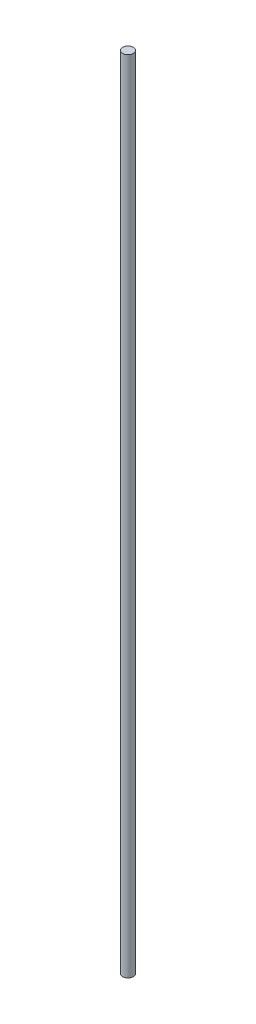
ISO-10303-21;
HEADER;
FILE_DESCRIPTION(('STEP AP214'),'2;1');
FILE_NAME('part.step','',(''),(''),'','','');
FILE_SCHEMA(('AUTOMOTIVE_DESIGN { 1 0 10303 214 1 1 1 1 }'));
ENDSEC;
DATA;
#1=APPLICATION_CONTEXT('core data for automotive mechanical design processes');
#2=APPLICATION_PROTOCOL_DEFINITION('international standard','automotive_design',2000,#1);
#3=PRODUCT_CONTEXT('',#1,'mechanical');
#4=PRODUCT('Part','Part','',(#3));
#5=PRODUCT_RELATED_PRODUCT_CATEGORY('part','',(#4));
#6=PRODUCT_DEFINITION_FORMATION('','',#4);
#7=PRODUCT_DEFINITION_CONTEXT('part definition',#1,'design');
#8=PRODUCT_DEFINITION('design','',#6,#7);
#9=PRODUCT_DEFINITION_SHAPE('','',#8);
#10=(LENGTH_UNIT() NAMED_UNIT(*) SI_UNIT(.MILLI.,.METRE.));
#11=(NAMED_UNIT(*) PLANE_ANGLE_UNIT() SI_UNIT($,.RADIAN.));
#12=(NAMED_UNIT(*) SI_UNIT($,.STERADIAN.) SOLID_ANGLE_UNIT());
#13=UNCERTAINTY_MEASURE_WITH_UNIT(LENGTH_MEASURE(1.E-05),#10,'distance_accuracy_value','');
#14=(GEOMETRIC_REPRESENTATION_CONTEXT(3) GLOBAL_UNCERTAINTY_ASSIGNED_CONTEXT((#13)) GLOBAL_UNIT_ASSIGNED_CONTEXT((#10,
#11,#12)) REPRESENTATION_CONTEXT('',''));
#15=CARTESIAN_POINT('',(0.,0.,0.));
#16=DIRECTION('',(0.,0.,1.));
#17=DIRECTION('',(1.,0.,0.));
#18=AXIS2_PLACEMENT_3D('',#15,#16,#17);
#19=CARTESIAN_POINT('',(0.,1500.,0.));
#20=DIRECTION('',(0.,-1.,0.));
#21=DIRECTION('',(0.,0.,-1.));
#22=AXIS2_PLACEMENT_3D('',#19,#20,#21);
#23=CYLINDRICAL_SURFACE('',#22,10.);
#24=CARTESIAN_POINT('',(0.,1500.,0.));
#25=DIRECTION('',(0.,1.,0.));
#26=DIRECTION('',(0.,0.,1.));
#27=AXIS2_PLACEMENT_3D('',#24,#25,#26);
#28=CIRCLE('',#27,10.);
#29=CARTESIAN_POINT('',(0.,1500.,10.));
#30=VERTEX_POINT('',#29);
#31=EDGE_CURVE('E10',#30,#30,#28,.T.);
#32=ORIENTED_EDGE('',*,*,#31,.F.);
#33=EDGE_LOOP('',(#32));
#34=FACE_BOUND('',#33,.T.);
#35=CARTESIAN_POINT('',(0.,0.,0.));
#36=DIRECTION('',(0.,1.,0.));
#37=DIRECTION('',(0.,0.,1.));
#38=AXIS2_PLACEMENT_3D('',#35,#36,#37);
#39=CIRCLE('',#38,10.);
#40=CARTESIAN_POINT('',(0.,0.,10.));
#41=VERTEX_POINT('',#40);
#42=EDGE_CURVE('E34',#41,#41,#39,.T.);
#43=ORIENTED_EDGE('',*,*,#42,.T.);
#44=EDGE_LOOP('',(#43));
#45=FACE_BOUND('',#44,.T.);
#46=ADVANCED_FACE('F31',(#34,#45),#23,.T.);
#47=CARTESIAN_POINT('',(0.,1500.,0.));
#48=DIRECTION('',(0.,1.,0.));
#49=DIRECTION('',(0.,0.,1.));
#50=AXIS2_PLACEMENT_3D('',#47,#48,#49);
#51=PLANE('',#50);
#52=ORIENTED_EDGE('',*,*,#31,.T.);
#53=EDGE_LOOP('',(#52));
#54=FACE_BOUND('',#53,.T.);
#55=ADVANCED_FACE('F46',(#54),#51,.T.);
#56=CARTESIAN_POINT('',(0.,0.,0.));
#57=DIRECTION('',(0.,1.,0.));
#58=DIRECTION('',(0.,0.,1.));
#59=AXIS2_PLACEMENT_3D('',#56,#57,#58);
#60=PLANE('',#59);
#61=ORIENTED_EDGE('',*,*,#42,.F.);
#62=EDGE_LOOP('',(#61));
#63=FACE_BOUND('',#62,.T.);
#64=ADVANCED_FACE('F44',(#63),#60,.F.);
#65=CLOSED_SHELL('',(#46,#55,#64));
#66=MANIFOLD_SOLID_BREP('B2',#65);
#67=ADVANCED_BREP_SHAPE_REPRESENTATION('',(#18,#66),#14);
#68=SHAPE_DEFINITION_REPRESENTATION(#9,#67);
ENDSEC;
END-ISO-10303-21;
